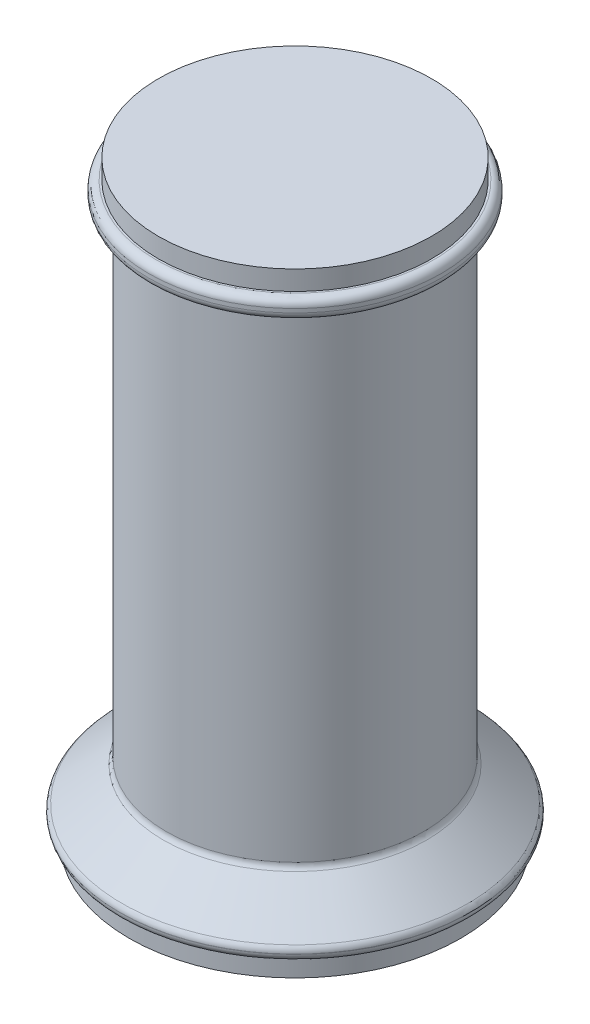
ISO-10303-21;
HEADER;
FILE_DESCRIPTION(('STEP AP214'),'2;1');
FILE_NAME('part.step','',(''),(''),'','','');
FILE_SCHEMA(('AUTOMOTIVE_DESIGN { 1 0 10303 214 1 1 1 1 }'));
ENDSEC;
DATA;
#1=APPLICATION_CONTEXT('core data for automotive mechanical design processes');
#2=APPLICATION_PROTOCOL_DEFINITION('international standard','automotive_design',2000,#1);
#3=PRODUCT_CONTEXT('',#1,'mechanical');
#4=PRODUCT('Part','Part','',(#3));
#5=PRODUCT_RELATED_PRODUCT_CATEGORY('part','',(#4));
#6=PRODUCT_DEFINITION_FORMATION('','',#4);
#7=PRODUCT_DEFINITION_CONTEXT('part definition',#1,'design');
#8=PRODUCT_DEFINITION('design','',#6,#7);
#9=PRODUCT_DEFINITION_SHAPE('','',#8);
#10=(LENGTH_UNIT() NAMED_UNIT(*) SI_UNIT(.MILLI.,.METRE.));
#11=(NAMED_UNIT(*) PLANE_ANGLE_UNIT() SI_UNIT($,.RADIAN.));
#12=(NAMED_UNIT(*) SI_UNIT($,.STERADIAN.) SOLID_ANGLE_UNIT());
#13=UNCERTAINTY_MEASURE_WITH_UNIT(LENGTH_MEASURE(1.E-05),#10,'distance_accuracy_value','');
#14=(GEOMETRIC_REPRESENTATION_CONTEXT(3) GLOBAL_UNCERTAINTY_ASSIGNED_CONTEXT((#13)) GLOBAL_UNIT_ASSIGNED_CONTEXT((#10,
#11,#12)) REPRESENTATION_CONTEXT('',''));
#15=CARTESIAN_POINT('',(0.,0.,0.));
#16=DIRECTION('',(0.,0.,1.));
#17=DIRECTION('',(1.,0.,0.));
#18=AXIS2_PLACEMENT_3D('',#15,#16,#17);
#19=CARTESIAN_POINT('',(0.,5.,0.));
#20=DIRECTION('',(0.,-1.,0.));
#21=DIRECTION('',(0.,0.,-1.));
#22=AXIS2_PLACEMENT_3D('',#19,#20,#21);
#23=CYLINDRICAL_SURFACE('',#22,42.5);
#24=CARTESIAN_POINT('',(0.,5.,0.));
#25=DIRECTION('',(0.,1.,0.));
#26=DIRECTION('',(0.,0.,1.));
#27=AXIS2_PLACEMENT_3D('',#24,#25,#26);
#28=CIRCLE('',#27,42.5);
#29=CARTESIAN_POINT('',(0.,5.,42.5));
#30=VERTEX_POINT('',#29);
#31=EDGE_CURVE('E83',#30,#30,#28,.T.);
#32=ORIENTED_EDGE('',*,*,#31,.F.);
#33=EDGE_LOOP('',(#32));
#34=FACE_BOUND('',#33,.T.);
#35=CARTESIAN_POINT('',(0.,0.,0.));
#36=DIRECTION('',(0.,1.,0.));
#37=DIRECTION('',(0.,0.,1.));
#38=AXIS2_PLACEMENT_3D('',#35,#36,#37);
#39=CIRCLE('',#38,42.5);
#40=CARTESIAN_POINT('',(0.,0.,42.5));
#41=VERTEX_POINT('',#40);
#42=EDGE_CURVE('E84',#41,#41,#39,.T.);
#43=ORIENTED_EDGE('',*,*,#42,.T.);
#44=EDGE_LOOP('',(#43));
#45=FACE_BOUND('',#44,.T.);
#46=ADVANCED_FACE('F39',(#34,#45),#23,.T.);
#47=CARTESIAN_POINT('',(0.,0.,0.));
#48=DIRECTION('',(0.,1.,0.));
#49=DIRECTION('',(0.,0.,1.));
#50=AXIS2_PLACEMENT_3D('',#47,#48,#49);
#51=PLANE('',#50);
#52=ORIENTED_EDGE('',*,*,#42,.F.);
#53=EDGE_LOOP('',(#52));
#54=FACE_BOUND('',#53,.T.);
#55=ADVANCED_FACE('F119',(#54),#51,.F.);
#56=CARTESIAN_POINT('',(0.,8.,0.));
#57=DIRECTION('',(0.,-1.,0.));
#58=DIRECTION('',(0.,0.,-1.));
#59=AXIS2_PLACEMENT_3D('',#56,#57,#58);
#60=CYLINDRICAL_SURFACE('',#59,45.);
#61=CARTESIAN_POINT('',(0.,7.,0.));
#62=DIRECTION('',(0.,1.,0.));
#63=DIRECTION('',(0.,0.,1.));
#64=AXIS2_PLACEMENT_3D('',#61,#62,#63);
#65=CIRCLE('',#64,45.);
#66=CARTESIAN_POINT('',(0.,7.,45.));
#67=VERTEX_POINT('',#66);
#68=EDGE_CURVE('E77',#67,#67,#65,.T.);
#69=ORIENTED_EDGE('',*,*,#68,.T.);
#70=EDGE_LOOP('',(#69));
#71=FACE_BOUND('',#70,.T.);
#72=CARTESIAN_POINT('',(0.,7.06325010803112,0.));
#73=DIRECTION('',(0.,-1.,0.));
#74=DIRECTION('',(0.,0.,-1.));
#75=AXIS2_PLACEMENT_3D('',#72,#73,#74);
#76=CIRCLE('',#75,45.);
#77=CARTESIAN_POINT('',(0.,7.06325010803112,-45.));
#78=VERTEX_POINT('',#77);
#79=EDGE_CURVE('E80',#78,#78,#76,.T.);
#80=ORIENTED_EDGE('',*,*,#79,.T.);
#81=EDGE_LOOP('',(#80));
#82=FACE_BOUND('',#81,.T.);
#83=ADVANCED_FACE('F125',(#71,#82),#60,.T.);
#84=CARTESIAN_POINT('',(0.,5.,0.));
#85=DIRECTION('',(0.,1.,0.));
#86=DIRECTION('',(0.,0.,1.));
#87=AXIS2_PLACEMENT_3D('',#84,#85,#86);
#88=PLANE('',#87);
#89=CARTESIAN_POINT('',(0.,5.,0.));
#90=DIRECTION('',(0.,1.,0.));
#91=DIRECTION('',(0.,0.,1.));
#92=AXIS2_PLACEMENT_3D('',#89,#90,#91);
#93=CIRCLE('',#92,43.);
#94=CARTESIAN_POINT('',(0.,5.,43.));
#95=VERTEX_POINT('',#94);
#96=EDGE_CURVE('E74',#95,#95,#93,.F.);
#97=ORIENTED_EDGE('',*,*,#96,.T.);
#98=EDGE_LOOP('',(#97));
#99=FACE_BOUND('',#98,.T.);
#100=ORIENTED_EDGE('',*,*,#31,.T.);
#101=EDGE_LOOP('',(#100));
#102=FACE_BOUND('',#101,.T.);
#103=ADVANCED_FACE('F231',(#99,#102),#88,.F.);
#104=CARTESIAN_POINT('',(0.,18.,0.));
#105=DIRECTION('',(0.,-1.,0.));
#106=DIRECTION('',(0.,0.,-1.));
#107=AXIS2_PLACEMENT_3D('',#104,#105,#106);
#108=CONICAL_SURFACE('',#107,33.,0.876058050598193);
#109=CARTESIAN_POINT('',(0.,8.59969266722588,0.));
#110=DIRECTION('',(0.,-1.,0.));
#111=DIRECTION('',(0.,0.,-1.));
#112=AXIS2_PLACEMENT_3D('',#109,#110,#111);
#113=CIRCLE('',#112,44.280368799329);
#114=CARTESIAN_POINT('',(0.,8.59969266722588,-44.280368799329));
#115=VERTEX_POINT('',#114);
#116=EDGE_CURVE('E68',#115,#115,#113,.F.);
#117=ORIENTED_EDGE('',*,*,#116,.T.);
#118=EDGE_LOOP('',(#117));
#119=FACE_BOUND('',#118,.T.);
#120=CARTESIAN_POINT('',(0.,17.4003073327741,0.));
#121=DIRECTION('',(0.,1.,0.));
#122=DIRECTION('',(0.,0.,1.));
#123=AXIS2_PLACEMENT_3D('',#120,#121,#122);
#124=CIRCLE('',#123,33.7196312006711);
#125=CARTESIAN_POINT('',(0.,17.4003073327741,33.7196312006711));
#126=VERTEX_POINT('',#125);
#127=EDGE_CURVE('E71',#126,#126,#124,.F.);
#128=ORIENTED_EDGE('',*,*,#127,.T.);
#129=EDGE_LOOP('',(#128));
#130=FACE_BOUND('',#129,.T.);
#131=ADVANCED_FACE('F222',(#119,#130),#108,.T.);
#132=CARTESIAN_POINT('',(0.,142.,0.));
#133=DIRECTION('',(0.,-1.,0.));
#134=DIRECTION('',(0.,0.,-1.));
#135=AXIS2_PLACEMENT_3D('',#132,#133,#134);
#136=CYLINDRICAL_SURFACE('',#135,33.);
#137=CARTESIAN_POINT('',(0.,140.,0.));
#138=DIRECTION('',(0.,1.,0.));
#139=DIRECTION('',(0.,0.,1.));
#140=AXIS2_PLACEMENT_3D('',#137,#138,#139);
#141=CIRCLE('',#140,33.);
#142=CARTESIAN_POINT('',(0.,140.,33.));
#143=VERTEX_POINT('',#142);
#144=EDGE_CURVE('E59',#143,#143,#141,.F.);
#145=ORIENTED_EDGE('',*,*,#144,.T.);
#146=EDGE_LOOP('',(#145));
#147=FACE_BOUND('',#146,.T.);
#148=CARTESIAN_POINT('',(0.,18.9367498919689,0.));
#149=DIRECTION('',(0.,1.,0.));
#150=DIRECTION('',(0.,0.,1.));
#151=AXIS2_PLACEMENT_3D('',#148,#149,#150);
#152=CIRCLE('',#151,33.);
#153=CARTESIAN_POINT('',(0.,18.9367498919689,33.));
#154=VERTEX_POINT('',#153);
#155=EDGE_CURVE('E62',#154,#154,#152,.T.);
#156=ORIENTED_EDGE('',*,*,#155,.T.);
#157=EDGE_LOOP('',(#156));
#158=FACE_BOUND('',#157,.T.);
#159=ADVANCED_FACE('F115',(#147,#158),#136,.T.);
#160=CARTESIAN_POINT('',(0.,147.,0.));
#161=DIRECTION('',(0.,-1.,0.));
#162=DIRECTION('',(0.,0.,-1.));
#163=AXIS2_PLACEMENT_3D('',#160,#161,#162);
#164=CYLINDRICAL_SURFACE('',#163,37.5);
#165=CARTESIAN_POINT('',(0.,144.,0.));
#166=DIRECTION('',(0.,1.,0.));
#167=DIRECTION('',(0.,0.,1.));
#168=AXIS2_PLACEMENT_3D('',#165,#166,#167);
#169=CIRCLE('',#168,37.5);
#170=CARTESIAN_POINT('',(0.,144.,37.5));
#171=VERTEX_POINT('',#170);
#172=EDGE_CURVE('E50',#171,#171,#169,.T.);
#173=ORIENTED_EDGE('',*,*,#172,.T.);
#174=EDGE_LOOP('',(#173));
#175=FACE_BOUND('',#174,.T.);
#176=CARTESIAN_POINT('',(0.,145.,0.));
#177=DIRECTION('',(0.,1.,0.));
#178=DIRECTION('',(0.,0.,1.));
#179=AXIS2_PLACEMENT_3D('',#176,#177,#178);
#180=CIRCLE('',#179,37.5);
#181=CARTESIAN_POINT('',(0.,145.,37.5));
#182=VERTEX_POINT('',#181);
#183=EDGE_CURVE('E54',#182,#182,#180,.F.);
#184=ORIENTED_EDGE('',*,*,#183,.T.);
#185=EDGE_LOOP('',(#184));
#186=FACE_BOUND('',#185,.T.);
#187=ADVANCED_FACE('F107',(#175,#186),#164,.T.);
#188=CARTESIAN_POINT('',(0.,147.,0.));
#189=DIRECTION('',(0.,1.,0.));
#190=DIRECTION('',(0.,0.,1.));
#191=AXIS2_PLACEMENT_3D('',#188,#189,#190);
#192=PLANE('',#191);
#193=CARTESIAN_POINT('',(0.,147.,0.));
#194=DIRECTION('',(0.,1.,0.));
#195=DIRECTION('',(0.,0.,1.));
#196=AXIS2_PLACEMENT_3D('',#193,#194,#195);
#197=CIRCLE('',#196,35.);
#198=CARTESIAN_POINT('',(0.,147.,35.));
#199=VERTEX_POINT('',#198);
#200=EDGE_CURVE('E90',#199,#199,#197,.T.);
#201=ORIENTED_EDGE('',*,*,#200,.F.);
#202=EDGE_LOOP('',(#201));
#203=FACE_BOUND('',#202,.T.);
#204=CARTESIAN_POINT('',(0.,147.,0.));
#205=DIRECTION('',(0.,1.,0.));
#206=DIRECTION('',(0.,0.,1.));
#207=AXIS2_PLACEMENT_3D('',#204,#205,#206);
#208=CIRCLE('',#207,35.5);
#209=CARTESIAN_POINT('',(0.,147.,35.5));
#210=VERTEX_POINT('',#209);
#211=EDGE_CURVE('E11',#210,#210,#208,.T.);
#212=ORIENTED_EDGE('',*,*,#211,.T.);
#213=EDGE_LOOP('',(#212));
#214=FACE_BOUND('',#213,.T.);
#215=ADVANCED_FACE('F104',(#203,#214),#192,.T.);
#216=CARTESIAN_POINT('',(0.,142.,0.));
#217=DIRECTION('',(0.,1.,0.));
#218=DIRECTION('',(0.,0.,1.));
#219=AXIS2_PLACEMENT_3D('',#216,#217,#218);
#220=PLANE('',#219);
#221=CARTESIAN_POINT('',(0.,142.,0.));
#222=DIRECTION('',(0.,1.,0.));
#223=DIRECTION('',(0.,0.,1.));
#224=AXIS2_PLACEMENT_3D('',#221,#222,#223);
#225=CIRCLE('',#224,35.5);
#226=CARTESIAN_POINT('',(0.,142.,35.5));
#227=VERTEX_POINT('',#226);
#228=EDGE_CURVE('E46',#227,#227,#225,.F.);
#229=ORIENTED_EDGE('',*,*,#228,.T.);
#230=EDGE_LOOP('',(#229));
#231=FACE_BOUND('',#230,.T.);
#232=CARTESIAN_POINT('',(0.,142.,0.));
#233=DIRECTION('',(0.,1.,0.));
#234=DIRECTION('',(0.,0.,1.));
#235=AXIS2_PLACEMENT_3D('',#232,#233,#234);
#236=CIRCLE('',#235,35.);
#237=CARTESIAN_POINT('',(0.,142.,35.));
#238=VERTEX_POINT('',#237);
#239=EDGE_CURVE('E65',#238,#238,#236,.T.);
#240=ORIENTED_EDGE('',*,*,#239,.T.);
#241=EDGE_LOOP('',(#240));
#242=FACE_BOUND('',#241,.T.);
#243=ADVANCED_FACE('F106',(#231,#242),#220,.F.);
#244=CARTESIAN_POINT('',(0.,7.,0.));
#245=DIRECTION('',(0.,1.,0.));
#246=DIRECTION('',(0.,0.,1.));
#247=AXIS2_PLACEMENT_3D('',#244,#245,#246);
#248=TOROIDAL_SURFACE('',#247,43.,2.);
#249=ORIENTED_EDGE('',*,*,#96,.F.);
#250=EDGE_LOOP('',(#249));
#251=FACE_BOUND('',#250,.T.);
#252=ORIENTED_EDGE('',*,*,#68,.F.);
#253=EDGE_LOOP('',(#252));
#254=FACE_BOUND('',#253,.T.);
#255=ADVANCED_FACE('F113',(#251,#254),#248,.T.);
#256=CARTESIAN_POINT('',(0.,7.06325010803112,0.));
#257=DIRECTION('',(0.,-1.,0.));
#258=DIRECTION('',(0.,0.,-1.));
#259=AXIS2_PLACEMENT_3D('',#256,#257,#258);
#260=TOROIDAL_SURFACE('',#259,43.,2.);
#261=ORIENTED_EDGE('',*,*,#79,.F.);
#262=EDGE_LOOP('',(#261));
#263=FACE_BOUND('',#262,.T.);
#264=ORIENTED_EDGE('',*,*,#116,.F.);
#265=EDGE_LOOP('',(#264));
#266=FACE_BOUND('',#265,.T.);
#267=ADVANCED_FACE('F134',(#263,#266),#260,.T.);
#268=CARTESIAN_POINT('',(0.,140.,0.));
#269=DIRECTION('',(0.,1.,0.));
#270=DIRECTION('',(0.,0.,1.));
#271=AXIS2_PLACEMENT_3D('',#268,#269,#270);
#272=TOROIDAL_SURFACE('',#271,35.,2.);
#273=ORIENTED_EDGE('',*,*,#144,.F.);
#274=EDGE_LOOP('',(#273));
#275=FACE_BOUND('',#274,.T.);
#276=ORIENTED_EDGE('',*,*,#239,.F.);
#277=EDGE_LOOP('',(#276));
#278=FACE_BOUND('',#277,.T.);
#279=ADVANCED_FACE('F138',(#275,#278),#272,.F.);
#280=CARTESIAN_POINT('',(0.,18.9367498919689,0.));
#281=DIRECTION('',(0.,1.,0.));
#282=DIRECTION('',(0.,0.,1.));
#283=AXIS2_PLACEMENT_3D('',#280,#281,#282);
#284=TOROIDAL_SURFACE('',#283,35.,2.);
#285=ORIENTED_EDGE('',*,*,#127,.F.);
#286=EDGE_LOOP('',(#285));
#287=FACE_BOUND('',#286,.T.);
#288=ORIENTED_EDGE('',*,*,#155,.F.);
#289=EDGE_LOOP('',(#288));
#290=FACE_BOUND('',#289,.T.);
#291=ADVANCED_FACE('F142',(#287,#290),#284,.F.);
#292=CARTESIAN_POINT('',(0.,144.,0.));
#293=DIRECTION('',(0.,1.,0.));
#294=DIRECTION('',(0.,0.,1.));
#295=AXIS2_PLACEMENT_3D('',#292,#293,#294);
#296=TOROIDAL_SURFACE('',#295,35.5,2.);
#297=ORIENTED_EDGE('',*,*,#228,.F.);
#298=EDGE_LOOP('',(#297));
#299=FACE_BOUND('',#298,.T.);
#300=ORIENTED_EDGE('',*,*,#172,.F.);
#301=EDGE_LOOP('',(#300));
#302=FACE_BOUND('',#301,.T.);
#303=ADVANCED_FACE('F145',(#299,#302),#296,.T.);
#304=CARTESIAN_POINT('',(0.,145.,0.));
#305=DIRECTION('',(0.,1.,0.));
#306=DIRECTION('',(0.,0.,1.));
#307=AXIS2_PLACEMENT_3D('',#304,#305,#306);
#308=TOROIDAL_SURFACE('',#307,35.5,2.);
#309=ORIENTED_EDGE('',*,*,#183,.F.);
#310=EDGE_LOOP('',(#309));
#311=FACE_BOUND('',#310,.T.);
#312=ORIENTED_EDGE('',*,*,#211,.F.);
#313=EDGE_LOOP('',(#312));
#314=FACE_BOUND('',#313,.T.);
#315=ADVANCED_FACE('F41',(#311,#314),#308,.T.);
#316=CARTESIAN_POINT('',(0.,152.,0.));
#317=DIRECTION('',(0.,-1.,0.));
#318=DIRECTION('',(0.,0.,-1.));
#319=AXIS2_PLACEMENT_3D('',#316,#317,#318);
#320=CYLINDRICAL_SURFACE('',#319,35.);
#321=CARTESIAN_POINT('',(0.,152.,0.));
#322=DIRECTION('',(0.,1.,0.));
#323=DIRECTION('',(0.,0.,1.));
#324=AXIS2_PLACEMENT_3D('',#321,#322,#323);
#325=CIRCLE('',#324,35.);
#326=CARTESIAN_POINT('',(0.,152.,35.));
#327=VERTEX_POINT('',#326);
#328=EDGE_CURVE('E87',#327,#327,#325,.T.);
#329=ORIENTED_EDGE('',*,*,#328,.F.);
#330=EDGE_LOOP('',(#329));
#331=FACE_BOUND('',#330,.T.);
#332=ORIENTED_EDGE('',*,*,#200,.T.);
#333=EDGE_LOOP('',(#332));
#334=FACE_BOUND('',#333,.T.);
#335=ADVANCED_FACE('F98',(#331,#334),#320,.T.);
#336=CARTESIAN_POINT('',(0.,152.,0.));
#337=DIRECTION('',(0.,1.,0.));
#338=DIRECTION('',(0.,0.,1.));
#339=AXIS2_PLACEMENT_3D('',#336,#337,#338);
#340=PLANE('',#339);
#341=ORIENTED_EDGE('',*,*,#328,.T.);
#342=EDGE_LOOP('',(#341));
#343=FACE_BOUND('',#342,.T.);
#344=ADVANCED_FACE('F96',(#343),#340,.T.);
#345=CLOSED_SHELL('',(#46,#55,#83,#103,#131,#159,#187,#215,#243,#255,#267,#279,#291,#303,#315,
#335,#344));
#346=MANIFOLD_SOLID_BREP('B2',#345);
#347=ADVANCED_BREP_SHAPE_REPRESENTATION('',(#18,#346),#14);
#348=SHAPE_DEFINITION_REPRESENTATION(#9,#347);
ENDSEC;
END-ISO-10303-21;
